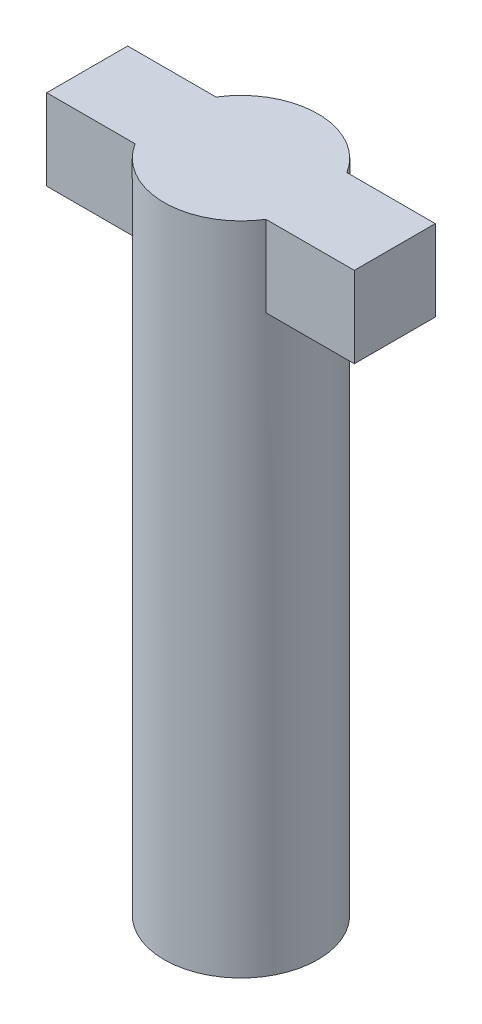
ISO-10303-21;
HEADER;
FILE_DESCRIPTION(('STEP AP214'),'2;1');
FILE_NAME('part.step','',(''),(''),'','','');
FILE_SCHEMA(('AUTOMOTIVE_DESIGN { 1 0 10303 214 1 1 1 1 }'));
ENDSEC;
DATA;
#1=APPLICATION_CONTEXT('core data for automotive mechanical design processes');
#2=APPLICATION_PROTOCOL_DEFINITION('international standard','automotive_design',2000,#1);
#3=PRODUCT_CONTEXT('',#1,'mechanical');
#4=PRODUCT('Part','Part','',(#3));
#5=PRODUCT_RELATED_PRODUCT_CATEGORY('part','',(#4));
#6=PRODUCT_DEFINITION_FORMATION('','',#4);
#7=PRODUCT_DEFINITION_CONTEXT('part definition',#1,'design');
#8=PRODUCT_DEFINITION('design','',#6,#7);
#9=PRODUCT_DEFINITION_SHAPE('','',#8);
#10=(LENGTH_UNIT() NAMED_UNIT(*) SI_UNIT(.MILLI.,.METRE.));
#11=(NAMED_UNIT(*) PLANE_ANGLE_UNIT() SI_UNIT($,.RADIAN.));
#12=(NAMED_UNIT(*) SI_UNIT($,.STERADIAN.) SOLID_ANGLE_UNIT());
#13=UNCERTAINTY_MEASURE_WITH_UNIT(LENGTH_MEASURE(1.E-05),#10,'distance_accuracy_value','');
#14=(GEOMETRIC_REPRESENTATION_CONTEXT(3) GLOBAL_UNCERTAINTY_ASSIGNED_CONTEXT((#13)) GLOBAL_UNIT_ASSIGNED_CONTEXT((#10,
#11,#12)) REPRESENTATION_CONTEXT('',''));
#15=CARTESIAN_POINT('',(0.,0.,0.));
#16=DIRECTION('',(0.,0.,1.));
#17=DIRECTION('',(1.,0.,0.));
#18=AXIS2_PLACEMENT_3D('',#15,#16,#17);
#19=CARTESIAN_POINT('',(0.,8.1,0.));
#20=DIRECTION('',(0.,-1.,0.));
#21=DIRECTION('',(0.,0.,-1.));
#22=AXIS2_PLACEMENT_3D('',#19,#20,#21);
#23=CYLINDRICAL_SURFACE('',#22,0.95);
#24=CARTESIAN_POINT('',(0.,7.1,0.));
#25=DIRECTION('',(0.,1.,0.));
#26=DIRECTION('',(0.,0.,1.));
#27=AXIS2_PLACEMENT_3D('',#24,#25,#26);
#28=CIRCLE('',#27,0.95);
#29=CARTESIAN_POINT('',(-0.807774721070176,7.1,-0.5));
#30=VERTEX_POINT('',#29);
#31=CARTESIAN_POINT('',(-0.807774721070176,7.1,0.5));
#32=VERTEX_POINT('',#31);
#33=EDGE_CURVE('E119',#30,#32,#28,.T.);
#34=ORIENTED_EDGE('',*,*,#33,.F.);
#35=DIRECTION('',(0.,1.,0.));
#36=VECTOR('',#35,1.);
#37=CARTESIAN_POINT('',(-0.807774721070176,7.1,-0.5));
#38=LINE('',#37,#36);
#39=CARTESIAN_POINT('',(-0.807774721070176,8.1,-0.5));
#40=VERTEX_POINT('',#39);
#41=EDGE_CURVE('E132',#30,#40,#38,.T.);
#42=ORIENTED_EDGE('',*,*,#41,.T.);
#43=CARTESIAN_POINT('',(0.,8.1,0.));
#44=DIRECTION('',(0.,1.,0.));
#45=DIRECTION('',(0.,0.,1.));
#46=AXIS2_PLACEMENT_3D('',#43,#44,#45);
#47=CIRCLE('',#46,0.95);
#48=CARTESIAN_POINT('',(0.807774721070176,8.1,-0.5));
#49=VERTEX_POINT('',#48);
#50=EDGE_CURVE('E11',#49,#40,#47,.T.);
#51=ORIENTED_EDGE('',*,*,#50,.F.);
#52=DIRECTION('',(0.,1.,0.));
#53=VECTOR('',#52,1.);
#54=CARTESIAN_POINT('',(0.807774721070176,7.1,-0.5));
#55=LINE('',#54,#53);
#56=CARTESIAN_POINT('',(0.807774721070176,7.1,-0.5));
#57=VERTEX_POINT('',#56);
#58=EDGE_CURVE('E157',#57,#49,#55,.T.);
#59=ORIENTED_EDGE('',*,*,#58,.F.);
#60=CARTESIAN_POINT('',(0.,7.1,0.));
#61=DIRECTION('',(0.,1.,0.));
#62=DIRECTION('',(0.,0.,1.));
#63=AXIS2_PLACEMENT_3D('',#60,#61,#62);
#64=CIRCLE('',#63,0.95);
#65=CARTESIAN_POINT('',(0.807774721070176,7.1,0.5));
#66=VERTEX_POINT('',#65);
#67=EDGE_CURVE('E149',#66,#57,#64,.T.);
#68=ORIENTED_EDGE('',*,*,#67,.F.);
#69=DIRECTION('',(0.,1.,0.));
#70=VECTOR('',#69,1.);
#71=CARTESIAN_POINT('',(0.807774721070176,7.1,0.5));
#72=LINE('',#71,#70);
#73=CARTESIAN_POINT('',(0.807774721070176,8.1,0.5));
#74=VERTEX_POINT('',#73);
#75=EDGE_CURVE('E168',#66,#74,#72,.T.);
#76=ORIENTED_EDGE('',*,*,#75,.T.);
#77=CARTESIAN_POINT('',(-0.807774721070176,8.1,0.5));
#78=VERTEX_POINT('',#77);
#79=EDGE_CURVE('E52',#78,#74,#47,.T.);
#80=ORIENTED_EDGE('',*,*,#79,.F.);
#81=DIRECTION('',(0.,1.,0.));
#82=VECTOR('',#81,1.);
#83=CARTESIAN_POINT('',(-0.807774721070176,7.1,0.5));
#84=LINE('',#83,#82);
#85=EDGE_CURVE('E143',#32,#78,#84,.T.);
#86=ORIENTED_EDGE('',*,*,#85,.F.);
#87=EDGE_LOOP('',(#34,#42,#51,#59,#68,#76,#80,#86));
#88=FACE_BOUND('',#87,.T.);
#89=CARTESIAN_POINT('',(0.,0.,0.));
#90=DIRECTION('',(0.,1.,0.));
#91=DIRECTION('',(0.,0.,1.));
#92=AXIS2_PLACEMENT_3D('',#89,#90,#91);
#93=CIRCLE('',#92,0.95);
#94=CARTESIAN_POINT('',(0.,0.,0.95));
#95=VERTEX_POINT('',#94);
#96=EDGE_CURVE('E47',#95,#95,#93,.T.);
#97=ORIENTED_EDGE('',*,*,#96,.T.);
#98=EDGE_LOOP('',(#97));
#99=FACE_BOUND('',#98,.T.);
#100=ADVANCED_FACE('F44',(#88,#99),#23,.T.);
#101=CARTESIAN_POINT('',(0.,8.1,0.));
#102=DIRECTION('',(0.,1.,0.));
#103=DIRECTION('',(0.,0.,1.));
#104=AXIS2_PLACEMENT_3D('',#101,#102,#103);
#105=PLANE('',#104);
#106=ORIENTED_EDGE('',*,*,#79,.T.);
#107=DIRECTION('',(1.,0.,0.));
#108=VECTOR('',#107,1.);
#109=CARTESIAN_POINT('',(0.,8.1,0.5));
#110=LINE('',#109,#108);
#111=CARTESIAN_POINT('',(1.9,8.1,0.5));
#112=VERTEX_POINT('',#111);
#113=EDGE_CURVE('E159',#74,#112,#110,.T.);
#114=ORIENTED_EDGE('',*,*,#113,.T.);
#115=DIRECTION('',(0.,0.,1.));
#116=VECTOR('',#115,1.);
#117=CARTESIAN_POINT('',(1.9,8.1,0.));
#118=LINE('',#117,#116);
#119=CARTESIAN_POINT('',(1.9,8.1,-0.5));
#120=VERTEX_POINT('',#119);
#121=EDGE_CURVE('E150',#120,#112,#118,.T.);
#122=ORIENTED_EDGE('',*,*,#121,.F.);
#123=DIRECTION('',(1.,0.,0.));
#124=VECTOR('',#123,1.);
#125=CARTESIAN_POINT('',(0.,8.1,-0.5));
#126=LINE('',#125,#124);
#127=EDGE_CURVE('E65',#49,#120,#126,.T.);
#128=ORIENTED_EDGE('',*,*,#127,.F.);
#129=ORIENTED_EDGE('',*,*,#50,.T.);
#130=DIRECTION('',(-1.,0.,0.));
#131=VECTOR('',#130,1.);
#132=CARTESIAN_POINT('',(0.,8.1,-0.5));
#133=LINE('',#132,#131);
#134=CARTESIAN_POINT('',(-1.9,8.1,-0.5));
#135=VERTEX_POINT('',#134);
#136=EDGE_CURVE('E138',#40,#135,#133,.T.);
#137=ORIENTED_EDGE('',*,*,#136,.T.);
#138=DIRECTION('',(0.,0.,1.));
#139=VECTOR('',#138,1.);
#140=CARTESIAN_POINT('',(-1.9,8.1,0.));
#141=LINE('',#140,#139);
#142=CARTESIAN_POINT('',(-1.9,8.1,0.5));
#143=VERTEX_POINT('',#142);
#144=EDGE_CURVE('E114',#135,#143,#141,.T.);
#145=ORIENTED_EDGE('',*,*,#144,.T.);
#146=DIRECTION('',(-1.,0.,0.));
#147=VECTOR('',#146,1.);
#148=CARTESIAN_POINT('',(0.,8.1,0.5));
#149=LINE('',#148,#147);
#150=EDGE_CURVE('E59',#78,#143,#149,.T.);
#151=ORIENTED_EDGE('',*,*,#150,.F.);
#152=EDGE_LOOP('',(#106,#114,#122,#128,#129,#137,#145,#151));
#153=FACE_BOUND('',#152,.T.);
#154=ADVANCED_FACE('F179',(#153),#105,.T.);
#155=CARTESIAN_POINT('',(0.,0.,0.));
#156=DIRECTION('',(0.,1.,0.));
#157=DIRECTION('',(0.,0.,1.));
#158=AXIS2_PLACEMENT_3D('',#155,#156,#157);
#159=PLANE('',#158);
#160=ORIENTED_EDGE('',*,*,#96,.F.);
#161=EDGE_LOOP('',(#160));
#162=FACE_BOUND('',#161,.T.);
#163=ADVANCED_FACE('F176',(#162),#159,.F.);
#164=CARTESIAN_POINT('',(0.,7.1,-0.5));
#165=DIRECTION('',(0.,0.,1.));
#166=DIRECTION('',(1.,0.,0.));
#167=AXIS2_PLACEMENT_3D('',#164,#165,#166);
#168=PLANE('',#167);
#169=ORIENTED_EDGE('',*,*,#127,.T.);
#170=DIRECTION('',(0.,1.,0.));
#171=VECTOR('',#170,1.);
#172=CARTESIAN_POINT('',(1.9,7.1,-0.5));
#173=LINE('',#172,#171);
#174=CARTESIAN_POINT('',(1.9,7.1,-0.5));
#175=VERTEX_POINT('',#174);
#176=EDGE_CURVE('E140',#175,#120,#173,.T.);
#177=ORIENTED_EDGE('',*,*,#176,.F.);
#178=DIRECTION('',(1.,0.,0.));
#179=VECTOR('',#178,1.);
#180=CARTESIAN_POINT('',(0.,7.1,-0.5));
#181=LINE('',#180,#179);
#182=EDGE_CURVE('E146',#57,#175,#181,.T.);
#183=ORIENTED_EDGE('',*,*,#182,.F.);
#184=ORIENTED_EDGE('',*,*,#58,.T.);
#185=EDGE_LOOP('',(#169,#177,#183,#184));
#186=FACE_BOUND('',#185,.T.);
#187=ADVANCED_FACE('F178',(#186),#168,.F.);
#188=CARTESIAN_POINT('',(1.9,7.1,0.));
#189=DIRECTION('',(-1.,0.,0.));
#190=DIRECTION('',(0.,0.,1.));
#191=AXIS2_PLACEMENT_3D('',#188,#189,#190);
#192=PLANE('',#191);
#193=ORIENTED_EDGE('',*,*,#121,.T.);
#194=DIRECTION('',(0.,1.,0.));
#195=VECTOR('',#194,1.);
#196=CARTESIAN_POINT('',(1.9,7.1,0.5));
#197=LINE('',#196,#195);
#198=CARTESIAN_POINT('',(1.9,7.1,0.5));
#199=VERTEX_POINT('',#198);
#200=EDGE_CURVE('E166',#199,#112,#197,.T.);
#201=ORIENTED_EDGE('',*,*,#200,.F.);
#202=DIRECTION('',(0.,0.,1.));
#203=VECTOR('',#202,1.);
#204=CARTESIAN_POINT('',(1.9,7.1,0.));
#205=LINE('',#204,#203);
#206=EDGE_CURVE('E155',#175,#199,#205,.T.);
#207=ORIENTED_EDGE('',*,*,#206,.F.);
#208=ORIENTED_EDGE('',*,*,#176,.T.);
#209=EDGE_LOOP('',(#193,#201,#207,#208));
#210=FACE_BOUND('',#209,.T.);
#211=ADVANCED_FACE('F184',(#210),#192,.F.);
#212=CARTESIAN_POINT('',(0.,7.1,0.5));
#213=DIRECTION('',(0.,0.,1.));
#214=DIRECTION('',(1.,0.,0.));
#215=AXIS2_PLACEMENT_3D('',#212,#213,#214);
#216=PLANE('',#215);
#217=ORIENTED_EDGE('',*,*,#113,.F.);
#218=ORIENTED_EDGE('',*,*,#75,.F.);
#219=DIRECTION('',(1.,0.,0.));
#220=VECTOR('',#219,1.);
#221=CARTESIAN_POINT('',(0.,7.1,0.5));
#222=LINE('',#221,#220);
#223=EDGE_CURVE('E152',#66,#199,#222,.T.);
#224=ORIENTED_EDGE('',*,*,#223,.T.);
#225=ORIENTED_EDGE('',*,*,#200,.T.);
#226=EDGE_LOOP('',(#217,#218,#224,#225));
#227=FACE_BOUND('',#226,.T.);
#228=ADVANCED_FACE('F205',(#227),#216,.T.);
#229=CARTESIAN_POINT('',(0.,7.1,0.));
#230=DIRECTION('',(0.,1.,0.));
#231=DIRECTION('',(0.,0.,1.));
#232=AXIS2_PLACEMENT_3D('',#229,#230,#231);
#233=PLANE('',#232);
#234=ORIENTED_EDGE('',*,*,#182,.T.);
#235=ORIENTED_EDGE('',*,*,#206,.T.);
#236=ORIENTED_EDGE('',*,*,#223,.F.);
#237=ORIENTED_EDGE('',*,*,#67,.T.);
#238=EDGE_LOOP('',(#234,#235,#236,#237));
#239=FACE_BOUND('',#238,.T.);
#240=ADVANCED_FACE('F201',(#239),#233,.F.);
#241=CARTESIAN_POINT('',(0.,7.1,-0.5));
#242=DIRECTION('',(0.,0.,-1.));
#243=DIRECTION('',(-1.,0.,0.));
#244=AXIS2_PLACEMENT_3D('',#241,#242,#243);
#245=PLANE('',#244);
#246=ORIENTED_EDGE('',*,*,#136,.F.);
#247=ORIENTED_EDGE('',*,*,#41,.F.);
#248=DIRECTION('',(-1.,0.,0.));
#249=VECTOR('',#248,1.);
#250=CARTESIAN_POINT('',(0.,7.1,-0.5));
#251=LINE('',#250,#249);
#252=CARTESIAN_POINT('',(-1.9,7.1,-0.5));
#253=VERTEX_POINT('',#252);
#254=EDGE_CURVE('E124',#30,#253,#251,.T.);
#255=ORIENTED_EDGE('',*,*,#254,.T.);
#256=DIRECTION('',(0.,1.,0.));
#257=VECTOR('',#256,1.);
#258=CARTESIAN_POINT('',(-1.9,7.1,-0.5));
#259=LINE('',#258,#257);
#260=EDGE_CURVE('E110',#253,#135,#259,.T.);
#261=ORIENTED_EDGE('',*,*,#260,.T.);
#262=EDGE_LOOP('',(#246,#247,#255,#261));
#263=FACE_BOUND('',#262,.T.);
#264=ADVANCED_FACE('F130',(#263),#245,.T.);
#265=CARTESIAN_POINT('',(0.,7.1,0.5));
#266=DIRECTION('',(0.,0.,-1.));
#267=DIRECTION('',(-1.,0.,0.));
#268=AXIS2_PLACEMENT_3D('',#265,#266,#267);
#269=PLANE('',#268);
#270=ORIENTED_EDGE('',*,*,#150,.T.);
#271=DIRECTION('',(0.,1.,0.));
#272=VECTOR('',#271,1.);
#273=CARTESIAN_POINT('',(-1.9,7.1,0.5));
#274=LINE('',#273,#272);
#275=CARTESIAN_POINT('',(-1.9,7.1,0.5));
#276=VERTEX_POINT('',#275);
#277=EDGE_CURVE('E118',#276,#143,#274,.T.);
#278=ORIENTED_EDGE('',*,*,#277,.F.);
#279=DIRECTION('',(-1.,0.,0.));
#280=VECTOR('',#279,1.);
#281=CARTESIAN_POINT('',(0.,7.1,0.5));
#282=LINE('',#281,#280);
#283=EDGE_CURVE('E127',#32,#276,#282,.T.);
#284=ORIENTED_EDGE('',*,*,#283,.F.);
#285=ORIENTED_EDGE('',*,*,#85,.T.);
#286=EDGE_LOOP('',(#270,#278,#284,#285));
#287=FACE_BOUND('',#286,.T.);
#288=ADVANCED_FACE('F195',(#287),#269,.F.);
#289=CARTESIAN_POINT('',(-1.9,7.1,0.));
#290=DIRECTION('',(-1.,0.,0.));
#291=DIRECTION('',(0.,0.,1.));
#292=AXIS2_PLACEMENT_3D('',#289,#290,#291);
#293=PLANE('',#292);
#294=ORIENTED_EDGE('',*,*,#144,.F.);
#295=ORIENTED_EDGE('',*,*,#260,.F.);
#296=DIRECTION('',(0.,0.,1.));
#297=VECTOR('',#296,1.);
#298=CARTESIAN_POINT('',(-1.9,7.1,0.));
#299=LINE('',#298,#297);
#300=EDGE_CURVE('E113',#253,#276,#299,.T.);
#301=ORIENTED_EDGE('',*,*,#300,.T.);
#302=ORIENTED_EDGE('',*,*,#277,.T.);
#303=EDGE_LOOP('',(#294,#295,#301,#302));
#304=FACE_BOUND('',#303,.T.);
#305=ADVANCED_FACE('F112',(#304),#293,.T.);
#306=CARTESIAN_POINT('',(0.,7.1,0.));
#307=DIRECTION('',(0.,1.,0.));
#308=DIRECTION('',(0.,0.,1.));
#309=AXIS2_PLACEMENT_3D('',#306,#307,#308);
#310=PLANE('',#309);
#311=ORIENTED_EDGE('',*,*,#254,.F.);
#312=ORIENTED_EDGE('',*,*,#33,.T.);
#313=ORIENTED_EDGE('',*,*,#283,.T.);
#314=ORIENTED_EDGE('',*,*,#300,.F.);
#315=EDGE_LOOP('',(#311,#312,#313,#314));
#316=FACE_BOUND('',#315,.T.);
#317=ADVANCED_FACE('F123',(#316),#310,.F.);
#318=CLOSED_SHELL('',(#100,#154,#163,#187,#211,#228,#240,#264,#288,#305,#317));
#319=MANIFOLD_SOLID_BREP('B2',#318);
#320=ADVANCED_BREP_SHAPE_REPRESENTATION('',(#18,#319),#14);
#321=SHAPE_DEFINITION_REPRESENTATION(#9,#320);
ENDSEC;
END-ISO-10303-21;
